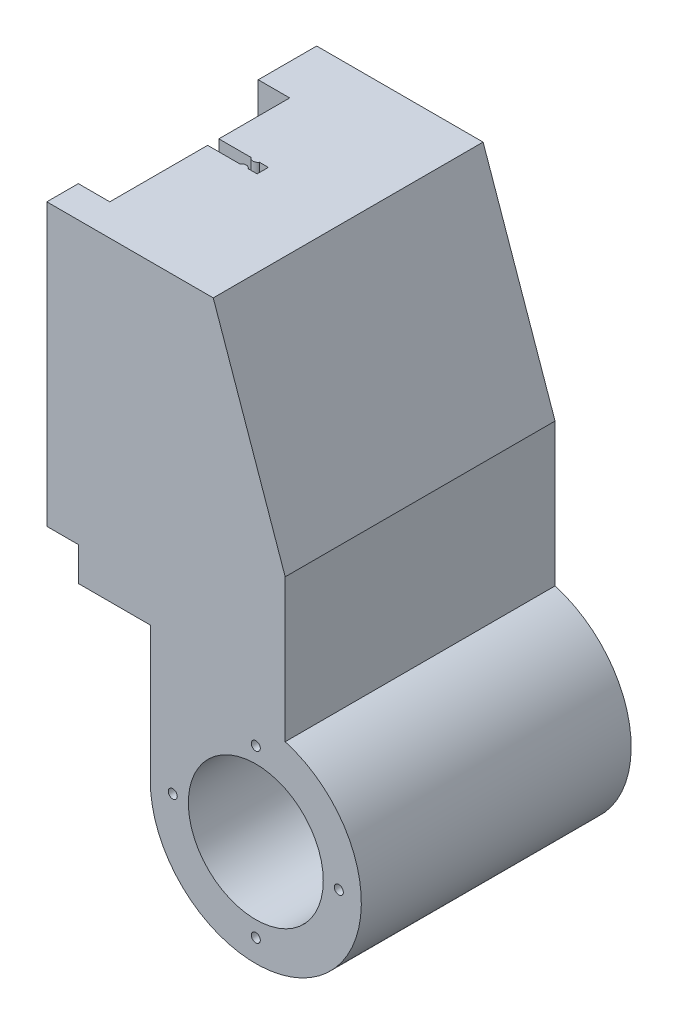
ISO-10303-21;
HEADER;
FILE_DESCRIPTION(('STEP AP214'),'2;1');
FILE_NAME('part.step','',(''),(''),'','','');
FILE_SCHEMA(('AUTOMOTIVE_DESIGN { 1 0 10303 214 1 1 1 1 }'));
ENDSEC;
DATA;
#1=APPLICATION_CONTEXT('core data for automotive mechanical design processes');
#2=APPLICATION_PROTOCOL_DEFINITION('international standard','automotive_design',2000,#1);
#3=PRODUCT_CONTEXT('',#1,'mechanical');
#4=PRODUCT('Part','Part','',(#3));
#5=PRODUCT_RELATED_PRODUCT_CATEGORY('part','',(#4));
#6=PRODUCT_DEFINITION_FORMATION('','',#4);
#7=PRODUCT_DEFINITION_CONTEXT('part definition',#1,'design');
#8=PRODUCT_DEFINITION('design','',#6,#7);
#9=PRODUCT_DEFINITION_SHAPE('','',#8);
#10=(LENGTH_UNIT() NAMED_UNIT(*) SI_UNIT(.MILLI.,.METRE.));
#11=(NAMED_UNIT(*) PLANE_ANGLE_UNIT() SI_UNIT($,.RADIAN.));
#12=(NAMED_UNIT(*) SI_UNIT($,.STERADIAN.) SOLID_ANGLE_UNIT());
#13=UNCERTAINTY_MEASURE_WITH_UNIT(LENGTH_MEASURE(1.E-05),#10,'distance_accuracy_value','');
#14=(GEOMETRIC_REPRESENTATION_CONTEXT(3) GLOBAL_UNCERTAINTY_ASSIGNED_CONTEXT((#13)) GLOBAL_UNIT_ASSIGNED_CONTEXT((#10,
#11,#12)) REPRESENTATION_CONTEXT('',''));
#15=CARTESIAN_POINT('',(0.,0.,0.));
#16=DIRECTION('',(0.,0.,1.));
#17=DIRECTION('',(1.,0.,0.));
#18=AXIS2_PLACEMENT_3D('',#15,#16,#17);
#19=CARTESIAN_POINT('',(-60.8511056883276,0.,0.75546179414232));
#20=DIRECTION('',(1.,0.,0.));
#21=DIRECTION('',(0.,0.,-1.));
#22=AXIS2_PLACEMENT_3D('',#19,#20,#21);
#23=PLANE('',#22);
#24=DIRECTION('',(0.,1.,0.));
#25=VECTOR('',#24,1.);
#26=CARTESIAN_POINT('',(-60.8511056883276,55.0725003083471,53.7554617941423));
#27=LINE('',#26,#25);
#28=CARTESIAN_POINT('',(-60.8511056883276,55.0725003083471,53.7554617941423));
#29=VERTEX_POINT('',#28);
#30=CARTESIAN_POINT('',(-60.8511056883276,117.572500308347,53.7554617941423));
#31=VERTEX_POINT('',#30);
#32=EDGE_CURVE('E300',#29,#31,#27,.T.);
#33=ORIENTED_EDGE('',*,*,#32,.T.);
#34=DIRECTION('',(0.,0.,1.));
#35=VECTOR('',#34,1.);
#36=CARTESIAN_POINT('',(-60.8511056883276,117.572500308347,0.75546179414232));
#37=LINE('',#36,#35);
#38=CARTESIAN_POINT('',(-60.8511056883276,117.572500308347,32.0054617941423));
#39=VERTEX_POINT('',#38);
#40=EDGE_CURVE('E265',#39,#31,#37,.T.);
#41=ORIENTED_EDGE('',*,*,#40,.F.);
#42=DIRECTION('',(0.,1.,0.));
#43=VECTOR('',#42,1.);
#44=CARTESIAN_POINT('',(-60.8511056883276,1.57250030834712,32.0054617941423));
#45=LINE('',#44,#43);
#46=CARTESIAN_POINT('',(-60.8511056883276,47.5725003083471,32.0054617941423));
#47=VERTEX_POINT('',#46);
#48=EDGE_CURVE('E240',#47,#39,#45,.T.);
#49=ORIENTED_EDGE('',*,*,#48,.F.);
#50=DIRECTION('',(0.,0.,-1.));
#51=VECTOR('',#50,1.);
#52=CARTESIAN_POINT('',(-60.8511056883276,47.5725003083471,0.75546179414232));
#53=LINE('',#52,#51);
#54=CARTESIAN_POINT('',(-60.8511056883276,47.5725003083471,60.7554617941423));
#55=VERTEX_POINT('',#54);
#56=EDGE_CURVE('E402',#55,#47,#53,.T.);
#57=ORIENTED_EDGE('',*,*,#56,.F.);
#58=DIRECTION('',(0.,1.,0.));
#59=VECTOR('',#58,1.);
#60=CARTESIAN_POINT('',(-60.8511056883276,16.6168869240189,60.7554617941423));
#61=LINE('',#60,#59);
#62=CARTESIAN_POINT('',(-60.8511056883276,55.0725003083471,60.7554617941423));
#63=VERTEX_POINT('',#62);
#64=EDGE_CURVE('E322',#55,#63,#61,.T.);
#65=ORIENTED_EDGE('',*,*,#64,.T.);
#66=DIRECTION('',(0.,0.,1.));
#67=VECTOR('',#66,1.);
#68=CARTESIAN_POINT('',(-60.8511056883276,55.0725003083471,0.));
#69=LINE('',#68,#67);
#70=EDGE_CURVE('E457',#29,#63,#69,.T.);
#71=ORIENTED_EDGE('',*,*,#70,.F.);
#72=EDGE_LOOP('',(#33,#41,#49,#57,#65,#71));
#73=FACE_BOUND('',#72,.T.);
#74=ADVANCED_FACE('F45',(#73),#23,.F.);
#75=CARTESIAN_POINT('',(0.,0.,60.7554617941423));
#76=DIRECTION('',(0.,0.,1.));
#77=DIRECTION('',(1.,0.,0.));
#78=AXIS2_PLACEMENT_3D('',#75,#76,#77);
#79=PLANE('',#78);
#80=CARTESIAN_POINT('',(-21.3871052024901,17.5725003083471,60.7554617941423));
#81=DIRECTION('',(0.,0.,1.));
#82=DIRECTION('',(1.,0.,0.));
#83=AXIS2_PLACEMENT_3D('',#80,#81,#82);
#84=CIRCLE('',#83,15.);
#85=CARTESIAN_POINT('',(-6.38710520249014,17.5725003083471,60.7554617941423));
#86=VERTEX_POINT('',#85);
#87=EDGE_CURVE('E334',#86,#86,#84,.T.);
#88=ORIENTED_EDGE('',*,*,#87,.F.);
#89=EDGE_LOOP('',(#88));
#90=FACE_BOUND('',#89,.T.);
#91=CARTESIAN_POINT('',(-21.3871052024901,36.0365007941846,60.7554617941423));
#92=DIRECTION('',(0.,0.,1.));
#93=DIRECTION('',(1.,0.,0.));
#94=AXIS2_PLACEMENT_3D('',#91,#92,#93);
#95=CIRCLE('',#94,1.);
#96=CARTESIAN_POINT('',(-20.3871052024901,36.0365007941846,60.7554617941423));
#97=VERTEX_POINT('',#96);
#98=EDGE_CURVE('E342',#97,#97,#95,.T.);
#99=ORIENTED_EDGE('',*,*,#98,.F.);
#100=EDGE_LOOP('',(#99));
#101=FACE_BOUND('',#100,.T.);
#102=CARTESIAN_POINT('',(-2.92310471665268,17.5725003083471,60.7554617941423));
#103=DIRECTION('',(0.,0.,1.));
#104=DIRECTION('',(1.,0.,0.));
#105=AXIS2_PLACEMENT_3D('',#102,#103,#104);
#106=CIRCLE('',#105,1.);
#107=CARTESIAN_POINT('',(-1.92310471665268,17.5725003083471,60.7554617941423));
#108=VERTEX_POINT('',#107);
#109=EDGE_CURVE('E348',#108,#108,#106,.T.);
#110=ORIENTED_EDGE('',*,*,#109,.F.);
#111=EDGE_LOOP('',(#110));
#112=FACE_BOUND('',#111,.T.);
#113=CARTESIAN_POINT('',(-21.3871052024901,-0.891500177490347,60.7554617941423));
#114=DIRECTION('',(0.,0.,1.));
#115=DIRECTION('',(1.,0.,0.));
#116=AXIS2_PLACEMENT_3D('',#113,#114,#115);
#117=CIRCLE('',#116,1.);
#118=CARTESIAN_POINT('',(-20.3871052024901,-0.891500177490347,60.7554617941423));
#119=VERTEX_POINT('',#118);
#120=EDGE_CURVE('E357',#119,#119,#117,.T.);
#121=ORIENTED_EDGE('',*,*,#120,.F.);
#122=EDGE_LOOP('',(#121));
#123=FACE_BOUND('',#122,.T.);
#124=CARTESIAN_POINT('',(-39.8511056883276,17.5725003083471,60.7554617941423));
#125=DIRECTION('',(0.,0.,1.));
#126=DIRECTION('',(1.,0.,0.));
#127=AXIS2_PLACEMENT_3D('',#124,#125,#126);
#128=CIRCLE('',#127,0.999999999999998);
#129=CARTESIAN_POINT('',(-38.8511056883276,17.5725003083471,60.7554617941423));
#130=VERTEX_POINT('',#129);
#131=EDGE_CURVE('E364',#130,#130,#128,.T.);
#132=ORIENTED_EDGE('',*,*,#131,.F.);
#133=EDGE_LOOP('',(#132));
#134=FACE_BOUND('',#133,.T.);
#135=DIRECTION('',(0.,1.,0.));
#136=VECTOR('',#135,1.);
#137=CARTESIAN_POINT('',(-44.8511056883276,1.57250030834712,60.7554617941423));
#138=LINE('',#137,#136);
#139=CARTESIAN_POINT('',(-44.8511056883276,17.5725003083471,60.7554617941423));
#140=VERTEX_POINT('',#139);
#141=CARTESIAN_POINT('',(-44.8511056883276,47.5725003083471,60.7554617941423));
#142=VERTEX_POINT('',#141);
#143=EDGE_CURVE('E406',#140,#142,#138,.T.);
#144=ORIENTED_EDGE('',*,*,#143,.F.);
#145=CARTESIAN_POINT('',(-21.3871052024901,17.5725003083471,60.7554617941423));
#146=DIRECTION('',(0.,0.,1.));
#147=DIRECTION('',(1.,0.,0.));
#148=AXIS2_PLACEMENT_3D('',#145,#146,#147);
#149=CIRCLE('',#148,23.4640004858375);
#150=CARTESIAN_POINT('',(-14.8511056883276,40.1078065887208,60.7554617941423));
#151=VERTEX_POINT('',#150);
#152=EDGE_CURVE('E286',#140,#151,#149,.T.);
#153=ORIENTED_EDGE('',*,*,#152,.T.);
#154=DIRECTION('',(0.,-1.,0.));
#155=VECTOR('',#154,1.);
#156=CARTESIAN_POINT('',(-14.8511056883276,0.,60.7554617941423));
#157=LINE('',#156,#155);
#158=CARTESIAN_POINT('',(-14.8511056883276,71.8582145940614,60.7554617941423));
#159=VERTEX_POINT('',#158);
#160=EDGE_CURVE('E249',#159,#151,#157,.T.);
#161=ORIENTED_EDGE('',*,*,#160,.F.);
#162=DIRECTION('',(0.330350424728106,-0.943858356366018,0.));
#163=VECTOR('',#162,1.);
#164=CARTESIAN_POINT('',(9.17529569674289,3.21135349386001,60.7554617941423));
#165=LINE('',#164,#163);
#166=CARTESIAN_POINT('',(-30.8511056883276,117.572500308347,60.7554617941423));
#167=VERTEX_POINT('',#166);
#168=EDGE_CURVE('E223',#167,#159,#165,.T.);
#169=ORIENTED_EDGE('',*,*,#168,.F.);
#170=DIRECTION('',(1.,0.,0.));
#171=VECTOR('',#170,1.);
#172=CARTESIAN_POINT('',(0.,117.572500308347,60.7554617941423));
#173=LINE('',#172,#171);
#174=CARTESIAN_POINT('',(-67.8511056883276,117.572500308347,60.7554617941423));
#175=VERTEX_POINT('',#174);
#176=EDGE_CURVE('E259',#175,#167,#173,.T.);
#177=ORIENTED_EDGE('',*,*,#176,.F.);
#178=DIRECTION('',(0.,1.,0.));
#179=VECTOR('',#178,1.);
#180=CARTESIAN_POINT('',(-67.8511056883276,55.0725003083471,60.7554617941423));
#181=LINE('',#180,#179);
#182=CARTESIAN_POINT('',(-67.8511056883276,55.0725003083471,60.7554617941423));
#183=VERTEX_POINT('',#182);
#184=EDGE_CURVE('E307',#183,#175,#181,.T.);
#185=ORIENTED_EDGE('',*,*,#184,.F.);
#186=DIRECTION('',(-1.,0.,0.));
#187=VECTOR('',#186,1.);
#188=CARTESIAN_POINT('',(0.,55.0725003083471,60.7554617941423));
#189=LINE('',#188,#187);
#190=EDGE_CURVE('E926',#63,#183,#189,.T.);
#191=ORIENTED_EDGE('',*,*,#190,.F.);
#192=ORIENTED_EDGE('',*,*,#64,.F.);
#193=DIRECTION('',(1.,0.,0.));
#194=VECTOR('',#193,1.);
#195=CARTESIAN_POINT('',(-60.8511056883276,47.5725003083471,60.7554617941423));
#196=LINE('',#195,#194);
#197=EDGE_CURVE('E315',#55,#142,#196,.T.);
#198=ORIENTED_EDGE('',*,*,#197,.T.);
#199=EDGE_LOOP('',(#144,#153,#161,#169,#177,#185,#191,#192,#198));
#200=FACE_BOUND('',#199,.T.);
#201=ADVANCED_FACE('F282',(#90,#101,#112,#123,#134,#200),#79,.T.);
#202=CARTESIAN_POINT('',(0.,0.,0.755461794142321));
#203=DIRECTION('',(0.,0.,1.));
#204=DIRECTION('',(1.,0.,0.));
#205=AXIS2_PLACEMENT_3D('',#202,#203,#204);
#206=PLANE('',#205);
#207=CARTESIAN_POINT('',(-21.3871052024901,17.5725003083471,0.75546179414232));
#208=DIRECTION('',(0.,0.,1.));
#209=DIRECTION('',(1.,0.,0.));
#210=AXIS2_PLACEMENT_3D('',#207,#208,#209);
#211=CIRCLE('',#210,15.);
#212=CARTESIAN_POINT('',(-6.38710520249014,17.5725003083471,0.75546179414232));
#213=VERTEX_POINT('',#212);
#214=EDGE_CURVE('E338',#213,#213,#211,.F.);
#215=ORIENTED_EDGE('',*,*,#214,.F.);
#216=EDGE_LOOP('',(#215));
#217=FACE_BOUND('',#216,.T.);
#218=CARTESIAN_POINT('',(-39.8511056883276,17.5725003083471,0.75546179414232));
#219=DIRECTION('',(0.,0.,1.));
#220=DIRECTION('',(1.,0.,0.));
#221=AXIS2_PLACEMENT_3D('',#218,#219,#220);
#222=CIRCLE('',#221,0.999999999999998);
#223=CARTESIAN_POINT('',(-38.8511056883276,17.5725003083471,0.75546179414232));
#224=VERTEX_POINT('',#223);
#225=EDGE_CURVE('E347',#224,#224,#222,.F.);
#226=ORIENTED_EDGE('',*,*,#225,.F.);
#227=EDGE_LOOP('',(#226));
#228=FACE_BOUND('',#227,.T.);
#229=CARTESIAN_POINT('',(-21.3871052024901,-0.891500177490347,0.75546179414232));
#230=DIRECTION('',(0.,0.,1.));
#231=DIRECTION('',(1.,0.,0.));
#232=AXIS2_PLACEMENT_3D('',#229,#230,#231);
#233=CIRCLE('',#232,1.);
#234=CARTESIAN_POINT('',(-20.3871052024901,-0.891500177490347,0.75546179414232));
#235=VERTEX_POINT('',#234);
#236=EDGE_CURVE('E368',#235,#235,#233,.F.);
#237=ORIENTED_EDGE('',*,*,#236,.F.);
#238=EDGE_LOOP('',(#237));
#239=FACE_BOUND('',#238,.T.);
#240=CARTESIAN_POINT('',(-2.92310471665268,17.5725003083471,0.75546179414232));
#241=DIRECTION('',(0.,0.,1.));
#242=DIRECTION('',(1.,0.,0.));
#243=AXIS2_PLACEMENT_3D('',#240,#241,#242);
#244=CIRCLE('',#243,1.);
#245=CARTESIAN_POINT('',(-1.92310471665268,17.5725003083471,0.75546179414232));
#246=VERTEX_POINT('',#245);
#247=EDGE_CURVE('E352',#246,#246,#244,.F.);
#248=ORIENTED_EDGE('',*,*,#247,.F.);
#249=EDGE_LOOP('',(#248));
#250=FACE_BOUND('',#249,.T.);
#251=CARTESIAN_POINT('',(-21.3871052024901,36.0365007941846,0.75546179414232));
#252=DIRECTION('',(0.,0.,1.));
#253=DIRECTION('',(1.,0.,0.));
#254=AXIS2_PLACEMENT_3D('',#251,#252,#253);
#255=CIRCLE('',#254,1.);
#256=CARTESIAN_POINT('',(-20.3871052024901,36.0365007941846,0.75546179414232));
#257=VERTEX_POINT('',#256);
#258=EDGE_CURVE('E353',#257,#257,#255,.F.);
#259=ORIENTED_EDGE('',*,*,#258,.F.);
#260=EDGE_LOOP('',(#259));
#261=FACE_BOUND('',#260,.T.);
#262=CARTESIAN_POINT('',(-21.3871052024901,17.5725003083471,0.75546179414232));
#263=DIRECTION('',(0.,0.,1.));
#264=DIRECTION('',(1.,0.,0.));
#265=AXIS2_PLACEMENT_3D('',#262,#263,#264);
#266=CIRCLE('',#265,23.4640004858375);
#267=CARTESIAN_POINT('',(-14.8511056883276,40.1078065887208,0.75546179414232));
#268=VERTEX_POINT('',#267);
#269=CARTESIAN_POINT('',(-44.8511056883276,17.5725003083471,0.75546179414232));
#270=VERTEX_POINT('',#269);
#271=EDGE_CURVE('E380',#268,#270,#266,.F.);
#272=ORIENTED_EDGE('',*,*,#271,.T.);
#273=DIRECTION('',(0.,1.,0.));
#274=VECTOR('',#273,1.);
#275=CARTESIAN_POINT('',(-44.8511056883276,1.57250030834712,0.75546179414232));
#276=LINE('',#275,#274);
#277=CARTESIAN_POINT('',(-44.8511056883276,47.5725003083471,0.75546179414232));
#278=VERTEX_POINT('',#277);
#279=EDGE_CURVE('E407',#270,#278,#276,.T.);
#280=ORIENTED_EDGE('',*,*,#279,.T.);
#281=DIRECTION('',(-1.,0.,0.));
#282=VECTOR('',#281,1.);
#283=CARTESIAN_POINT('',(-44.8511056883276,47.5725003083471,0.75546179414232));
#284=LINE('',#283,#282);
#285=CARTESIAN_POINT('',(-60.8511056883276,47.5725003083471,0.75546179414232));
#286=VERTEX_POINT('',#285);
#287=EDGE_CURVE('E71',#278,#286,#284,.T.);
#288=ORIENTED_EDGE('',*,*,#287,.T.);
#289=DIRECTION('',(0.,1.,0.));
#290=VECTOR('',#289,1.);
#291=CARTESIAN_POINT('',(-60.8511056883276,16.6168869240189,0.75546179414232));
#292=LINE('',#291,#290);
#293=CARTESIAN_POINT('',(-60.8511056883276,55.0725003083471,0.75546179414232));
#294=VERTEX_POINT('',#293);
#295=EDGE_CURVE('E330',#286,#294,#292,.T.);
#296=ORIENTED_EDGE('',*,*,#295,.T.);
#297=DIRECTION('',(-1.,0.,0.));
#298=VECTOR('',#297,1.);
#299=CARTESIAN_POINT('',(0.,55.0725003083471,0.755461794142313));
#300=LINE('',#299,#298);
#301=CARTESIAN_POINT('',(-67.8511056883276,55.0725003083471,0.755461794142321));
#302=VERTEX_POINT('',#301);
#303=EDGE_CURVE('E310',#294,#302,#300,.T.);
#304=ORIENTED_EDGE('',*,*,#303,.T.);
#305=DIRECTION('',(0.,1.,0.));
#306=VECTOR('',#305,1.);
#307=CARTESIAN_POINT('',(-67.8511056883276,55.0725003083471,0.755461794142321));
#308=LINE('',#307,#306);
#309=CARTESIAN_POINT('',(-67.8511056883276,117.572500308347,0.755461794142321));
#310=VERTEX_POINT('',#309);
#311=EDGE_CURVE('E294',#302,#310,#308,.T.);
#312=ORIENTED_EDGE('',*,*,#311,.T.);
#313=DIRECTION('',(1.,0.,0.));
#314=VECTOR('',#313,1.);
#315=CARTESIAN_POINT('',(0.,117.572500308347,0.75546179414232));
#316=LINE('',#315,#314);
#317=CARTESIAN_POINT('',(-30.8511056883276,117.572500308347,0.75546179414232));
#318=VERTEX_POINT('',#317);
#319=EDGE_CURVE('E248',#310,#318,#316,.T.);
#320=ORIENTED_EDGE('',*,*,#319,.T.);
#321=DIRECTION('',(0.330350424728106,-0.943858356366018,0.));
#322=VECTOR('',#321,1.);
#323=CARTESIAN_POINT('',(9.17529569674289,3.21135349386001,0.75546179414232));
#324=LINE('',#323,#322);
#325=CARTESIAN_POINT('',(-14.8511056883276,71.8582145940614,0.75546179414232));
#326=VERTEX_POINT('',#325);
#327=EDGE_CURVE('E244',#318,#326,#324,.T.);
#328=ORIENTED_EDGE('',*,*,#327,.T.);
#329=DIRECTION('',(0.,-1.,0.));
#330=VECTOR('',#329,1.);
#331=CARTESIAN_POINT('',(-14.8511056883276,0.,0.75546179414232));
#332=LINE('',#331,#330);
#333=EDGE_CURVE('E252',#326,#268,#332,.T.);
#334=ORIENTED_EDGE('',*,*,#333,.T.);
#335=EDGE_LOOP('',(#272,#280,#288,#296,#304,#312,#320,#328,#334));
#336=FACE_BOUND('',#335,.T.);
#337=ADVANCED_FACE('F47',(#217,#228,#239,#250,#261,#336),#206,.F.);
#338=CARTESIAN_POINT('',(-44.8511056883276,0.,60.7554617941423));
#339=DIRECTION('',(-1.,0.,0.));
#340=DIRECTION('',(0.,0.,1.));
#341=AXIS2_PLACEMENT_3D('',#338,#339,#340);
#342=PLANE('',#341);
#343=ORIENTED_EDGE('',*,*,#279,.F.);
#344=DIRECTION('',(0.,0.,1.));
#345=VECTOR('',#344,1.);
#346=CARTESIAN_POINT('',(-44.8511056883276,17.5725003083471,-11.4411521578247));
#347=LINE('',#346,#345);
#348=EDGE_CURVE('E343',#270,#140,#347,.T.);
#349=ORIENTED_EDGE('',*,*,#348,.T.);
#350=ORIENTED_EDGE('',*,*,#143,.T.);
#351=DIRECTION('',(0.,0.,-1.));
#352=VECTOR('',#351,1.);
#353=CARTESIAN_POINT('',(-44.8511056883276,47.5725003083471,60.7554617941423));
#354=LINE('',#353,#352);
#355=EDGE_CURVE('E385',#142,#278,#354,.T.);
#356=ORIENTED_EDGE('',*,*,#355,.T.);
#357=EDGE_LOOP('',(#343,#349,#350,#356));
#358=FACE_BOUND('',#357,.T.);
#359=ADVANCED_FACE('F522',(#358),#342,.T.);
#360=CARTESIAN_POINT('',(-60.8511056883276,117.572500308347,13.7554617941423));
#361=VERTEX_POINT('',#360);
#362=CARTESIAN_POINT('',(-60.8511056883276,117.572500308347,29.5054617941423));
#363=VERTEX_POINT('',#362);
#364=EDGE_CURVE('E55',#361,#363,#37,.T.);
#365=ORIENTED_EDGE('',*,*,#364,.F.);
#366=DIRECTION('',(0.,1.,0.));
#367=VECTOR('',#366,1.);
#368=CARTESIAN_POINT('',(-60.8511056883276,55.0725003083471,13.7554617941423));
#369=LINE('',#368,#367);
#370=CARTESIAN_POINT('',(-60.8511056883276,55.0725003083471,13.7554617941423));
#371=VERTEX_POINT('',#370);
#372=EDGE_CURVE('E316',#371,#361,#369,.T.);
#373=ORIENTED_EDGE('',*,*,#372,.F.);
#374=DIRECTION('',(0.,0.,1.));
#375=VECTOR('',#374,1.);
#376=CARTESIAN_POINT('',(-60.8511056883276,55.0725003083471,0.));
#377=LINE('',#376,#375);
#378=EDGE_CURVE('E484',#294,#371,#377,.T.);
#379=ORIENTED_EDGE('',*,*,#378,.F.);
#380=ORIENTED_EDGE('',*,*,#295,.F.);
#381=DIRECTION('',(0.,0.,-1.));
#382=VECTOR('',#381,1.);
#383=CARTESIAN_POINT('',(-60.8511056883276,47.5725003083471,0.75546179414232));
#384=LINE('',#383,#382);
#385=CARTESIAN_POINT('',(-60.8511056883276,47.5725003083471,29.5054617941423));
#386=VERTEX_POINT('',#385);
#387=EDGE_CURVE('E389',#386,#286,#384,.T.);
#388=ORIENTED_EDGE('',*,*,#387,.F.);
#389=DIRECTION('',(0.,1.,0.));
#390=VECTOR('',#389,1.);
#391=CARTESIAN_POINT('',(-60.8511056883276,1.57250030834712,29.5054617941423));
#392=LINE('',#391,#390);
#393=EDGE_CURVE('E219',#386,#363,#392,.T.);
#394=ORIENTED_EDGE('',*,*,#393,.T.);
#395=EDGE_LOOP('',(#365,#373,#379,#380,#388,#394));
#396=FACE_BOUND('',#395,.T.);
#397=ADVANCED_FACE('F495',(#396),#23,.F.);
#398=CARTESIAN_POINT('',(-52.7588599983276,1.57250030834712,28.9161760798566));
#399=DIRECTION('',(0.,1.,0.));
#400=DIRECTION('',(0.,0.,1.));
#401=AXIS2_PLACEMENT_3D('',#398,#399,#400);
#402=CYLINDRICAL_SURFACE('',#401,1.09224569);
#403=CARTESIAN_POINT('',(-52.7588599983276,87.5725003083471,28.9161760798566));
#404=DIRECTION('',(0.,1.,0.));
#405=DIRECTION('',(0.,0.,1.));
#406=AXIS2_PLACEMENT_3D('',#403,#404,#405);
#407=CIRCLE('',#406,1.09224569);
#408=CARTESIAN_POINT('',(-51.8392171359825,87.5725003083471,29.5054617941423));
#409=VERTEX_POINT('',#408);
#410=CARTESIAN_POINT('',(-53.6785028606727,87.5725003083471,29.5054617941423));
#411=VERTEX_POINT('',#410);
#412=EDGE_CURVE('E193',#409,#411,#407,.F.);
#413=ORIENTED_EDGE('',*,*,#412,.F.);
#414=DIRECTION('',(0.,1.,0.));
#415=VECTOR('',#414,1.);
#416=CARTESIAN_POINT('',(-51.8392171359825,1.57250030834712,29.5054617941423));
#417=LINE('',#416,#415);
#418=CARTESIAN_POINT('',(-51.8392171359825,117.572500308347,29.5054617941423));
#419=VERTEX_POINT('',#418);
#420=EDGE_CURVE('E210',#409,#419,#417,.T.);
#421=ORIENTED_EDGE('',*,*,#420,.T.);
#422=CARTESIAN_POINT('',(-52.7588599983276,117.572500308347,28.9161760798566));
#423=DIRECTION('',(0.,1.,0.));
#424=DIRECTION('',(0.,0.,1.));
#425=AXIS2_PLACEMENT_3D('',#422,#423,#424);
#426=CIRCLE('',#425,1.09224569);
#427=CARTESIAN_POINT('',(-53.6785028606727,117.572500308347,29.5054617941423));
#428=VERTEX_POINT('',#427);
#429=EDGE_CURVE('E216',#428,#419,#426,.T.);
#430=ORIENTED_EDGE('',*,*,#429,.F.);
#431=DIRECTION('',(0.,1.,0.));
#432=VECTOR('',#431,1.);
#433=CARTESIAN_POINT('',(-53.6785028606727,1.57250030834712,29.5054617941423));
#434=LINE('',#433,#432);
#435=EDGE_CURVE('E207',#411,#428,#434,.T.);
#436=ORIENTED_EDGE('',*,*,#435,.F.);
#437=EDGE_LOOP('',(#413,#421,#430,#436));
#438=FACE_BOUND('',#437,.T.);
#439=ADVANCED_FACE('F214',(#438),#402,.T.);
#440=CARTESIAN_POINT('',(0.,1.57250030834712,29.5054617941423));
#441=DIRECTION('',(0.,0.,-1.));
#442=DIRECTION('',(-1.,0.,0.));
#443=AXIS2_PLACEMENT_3D('',#440,#441,#442);
#444=PLANE('',#443);
#445=ORIENTED_EDGE('',*,*,#420,.F.);
#446=DIRECTION('',(1.,0.,0.));
#447=VECTOR('',#446,1.);
#448=CARTESIAN_POINT('',(-49.8511056883276,87.5725003083471,29.5054617941423));
#449=LINE('',#448,#447);
#450=EDGE_CURVE('E196',#411,#409,#449,.T.);
#451=ORIENTED_EDGE('',*,*,#450,.F.);
#452=ORIENTED_EDGE('',*,*,#435,.T.);
#453=DIRECTION('',(-1.,0.,0.));
#454=VECTOR('',#453,1.);
#455=CARTESIAN_POINT('',(0.,117.572500308347,29.5054617941423));
#456=LINE('',#455,#454);
#457=EDGE_CURVE('E243',#428,#363,#456,.T.);
#458=ORIENTED_EDGE('',*,*,#457,.T.);
#459=ORIENTED_EDGE('',*,*,#393,.F.);
#460=DIRECTION('',(-1.,0.,0.));
#461=VECTOR('',#460,1.);
#462=CARTESIAN_POINT('',(0.,47.5725003083471,29.5054617941423));
#463=LINE('',#462,#461);
#464=CARTESIAN_POINT('',(-49.8511056883276,47.5725003083471,29.5054617941423));
#465=VERTEX_POINT('',#464);
#466=EDGE_CURVE('E392',#465,#386,#463,.T.);
#467=ORIENTED_EDGE('',*,*,#466,.F.);
#468=DIRECTION('',(0.,1.,0.));
#469=VECTOR('',#468,1.);
#470=CARTESIAN_POINT('',(-49.8511056883276,1.57250030834712,29.5054617941423));
#471=LINE('',#470,#469);
#472=CARTESIAN_POINT('',(-49.8511056883276,117.572500308347,29.5054617941423));
#473=VERTEX_POINT('',#472);
#474=EDGE_CURVE('E225',#465,#473,#471,.T.);
#475=ORIENTED_EDGE('',*,*,#474,.T.);
#476=DIRECTION('',(-1.,0.,0.));
#477=VECTOR('',#476,1.);
#478=CARTESIAN_POINT('',(0.,117.572500308347,29.5054617941423));
#479=LINE('',#478,#477);
#480=EDGE_CURVE('E428',#473,#419,#479,.T.);
#481=ORIENTED_EDGE('',*,*,#480,.T.);
#482=EDGE_LOOP('',(#445,#451,#452,#458,#459,#467,#475,#481));
#483=FACE_BOUND('',#482,.T.);
#484=ADVANCED_FACE('F205',(#483),#444,.F.);
#485=CARTESIAN_POINT('',(-49.8511056883276,1.57250030834712,0.));
#486=DIRECTION('',(-1.,0.,0.));
#487=DIRECTION('',(0.,0.,1.));
#488=AXIS2_PLACEMENT_3D('',#485,#486,#487);
#489=PLANE('',#488);
#490=DIRECTION('',(0.,0.,1.));
#491=VECTOR('',#490,1.);
#492=CARTESIAN_POINT('',(-49.8511056883276,117.572500308347,0.));
#493=LINE('',#492,#491);
#494=CARTESIAN_POINT('',(-49.8511056883276,117.572500308347,32.0054617941423));
#495=VERTEX_POINT('',#494);
#496=EDGE_CURVE('E424',#473,#495,#493,.T.);
#497=ORIENTED_EDGE('',*,*,#496,.F.);
#498=ORIENTED_EDGE('',*,*,#474,.F.);
#499=DIRECTION('',(0.,0.,1.));
#500=VECTOR('',#499,1.);
#501=CARTESIAN_POINT('',(-49.8511056883276,47.5725003083471,0.));
#502=LINE('',#501,#500);
#503=CARTESIAN_POINT('',(-49.8511056883276,47.5725003083471,32.0054617941423));
#504=VERTEX_POINT('',#503);
#505=EDGE_CURVE('E395',#465,#504,#502,.T.);
#506=ORIENTED_EDGE('',*,*,#505,.T.);
#507=DIRECTION('',(0.,1.,0.));
#508=VECTOR('',#507,1.);
#509=CARTESIAN_POINT('',(-49.8511056883276,1.57250030834712,32.0054617941423));
#510=LINE('',#509,#508);
#511=EDGE_CURVE('E231',#504,#495,#510,.T.);
#512=ORIENTED_EDGE('',*,*,#511,.T.);
#513=EDGE_LOOP('',(#497,#498,#506,#512));
#514=FACE_BOUND('',#513,.T.);
#515=ADVANCED_FACE('F439',(#514),#489,.T.);
#516=CARTESIAN_POINT('',(-52.7588599983276,1.57250030834712,32.594747508428));
#517=DIRECTION('',(0.,1.,0.));
#518=DIRECTION('',(0.,0.,1.));
#519=AXIS2_PLACEMENT_3D('',#516,#517,#518);
#520=CYLINDRICAL_SURFACE('',#519,1.09224569);
#521=CARTESIAN_POINT('',(-52.7588599983276,87.5725003083471,32.594747508428));
#522=DIRECTION('',(0.,1.,0.));
#523=DIRECTION('',(0.,0.,1.));
#524=AXIS2_PLACEMENT_3D('',#521,#522,#523);
#525=CIRCLE('',#524,1.09224569);
#526=CARTESIAN_POINT('',(-53.6785028606727,87.5725003083471,32.0054617941423));
#527=VERTEX_POINT('',#526);
#528=CARTESIAN_POINT('',(-51.8392171359825,87.5725003083471,32.0054617941423));
#529=VERTEX_POINT('',#528);
#530=EDGE_CURVE('E202',#527,#529,#525,.F.);
#531=ORIENTED_EDGE('',*,*,#530,.F.);
#532=DIRECTION('',(0.,1.,0.));
#533=VECTOR('',#532,1.);
#534=CARTESIAN_POINT('',(-53.6785028606727,1.57250030834712,32.0054617941423));
#535=LINE('',#534,#533);
#536=CARTESIAN_POINT('',(-53.6785028606727,117.572500308347,32.0054617941423));
#537=VERTEX_POINT('',#536);
#538=EDGE_CURVE('E237',#527,#537,#535,.T.);
#539=ORIENTED_EDGE('',*,*,#538,.T.);
#540=CARTESIAN_POINT('',(-52.7588599983276,117.572500308347,32.594747508428));
#541=DIRECTION('',(0.,1.,0.));
#542=DIRECTION('',(0.,0.,1.));
#543=AXIS2_PLACEMENT_3D('',#540,#541,#542);
#544=CIRCLE('',#543,1.09224569);
#545=CARTESIAN_POINT('',(-51.8392171359825,117.572500308347,32.0054617941423));
#546=VERTEX_POINT('',#545);
#547=EDGE_CURVE('E416',#546,#537,#544,.T.);
#548=ORIENTED_EDGE('',*,*,#547,.F.);
#549=DIRECTION('',(0.,1.,0.));
#550=VECTOR('',#549,1.);
#551=CARTESIAN_POINT('',(-51.8392171359825,1.57250030834712,32.0054617941423));
#552=LINE('',#551,#550);
#553=EDGE_CURVE('E234',#529,#546,#552,.T.);
#554=ORIENTED_EDGE('',*,*,#553,.F.);
#555=EDGE_LOOP('',(#531,#539,#548,#554));
#556=FACE_BOUND('',#555,.T.);
#557=ADVANCED_FACE('F451',(#556),#520,.T.);
#558=CARTESIAN_POINT('',(0.,1.57250030834712,32.0054617941423));
#559=DIRECTION('',(0.,0.,-1.));
#560=DIRECTION('',(-1.,0.,0.));
#561=AXIS2_PLACEMENT_3D('',#558,#559,#560);
#562=PLANE('',#561);
#563=ORIENTED_EDGE('',*,*,#538,.F.);
#564=DIRECTION('',(-1.,0.,0.));
#565=VECTOR('',#564,1.);
#566=CARTESIAN_POINT('',(-60.8511056883276,87.5725003083471,32.0054617941423));
#567=LINE('',#566,#565);
#568=EDGE_CURVE('E212',#529,#527,#567,.T.);
#569=ORIENTED_EDGE('',*,*,#568,.F.);
#570=ORIENTED_EDGE('',*,*,#553,.T.);
#571=DIRECTION('',(-1.,0.,0.));
#572=VECTOR('',#571,1.);
#573=CARTESIAN_POINT('',(0.,117.572500308347,32.0054617941423));
#574=LINE('',#573,#572);
#575=EDGE_CURVE('E420',#495,#546,#574,.T.);
#576=ORIENTED_EDGE('',*,*,#575,.F.);
#577=ORIENTED_EDGE('',*,*,#511,.F.);
#578=DIRECTION('',(-1.,0.,0.));
#579=VECTOR('',#578,1.);
#580=CARTESIAN_POINT('',(0.,47.5725003083471,32.0054617941423));
#581=LINE('',#580,#579);
#582=EDGE_CURVE('E399',#504,#47,#581,.T.);
#583=ORIENTED_EDGE('',*,*,#582,.T.);
#584=ORIENTED_EDGE('',*,*,#48,.T.);
#585=DIRECTION('',(-1.,0.,0.));
#586=VECTOR('',#585,1.);
#587=CARTESIAN_POINT('',(0.,117.572500308347,32.0054617941423));
#588=LINE('',#587,#586);
#589=EDGE_CURVE('E410',#537,#39,#588,.T.);
#590=ORIENTED_EDGE('',*,*,#589,.F.);
#591=EDGE_LOOP('',(#563,#569,#570,#576,#577,#583,#584,#590));
#592=FACE_BOUND('',#591,.T.);
#593=ADVANCED_FACE('F444',(#592),#562,.T.);
#594=CARTESIAN_POINT('',(9.17529569674289,3.21135349386001,0.75546179414232));
#595=DIRECTION('',(-0.943858356366017,-0.330350424728106,0.));
#596=DIRECTION('',(0.330350424728106,-0.943858356366017,0.));
#597=AXIS2_PLACEMENT_3D('',#594,#595,#596);
#598=PLANE('',#597);
#599=ORIENTED_EDGE('',*,*,#168,.T.);
#600=DIRECTION('',(0.,0.,1.));
#601=VECTOR('',#600,1.);
#602=CARTESIAN_POINT('',(-14.8511056883276,71.8582145940614,0.75546179414232));
#603=LINE('',#602,#601);
#604=EDGE_CURVE('E11',#326,#159,#603,.T.);
#605=ORIENTED_EDGE('',*,*,#604,.F.);
#606=ORIENTED_EDGE('',*,*,#327,.F.);
#607=DIRECTION('',(0.,0.,1.));
#608=VECTOR('',#607,1.);
#609=CARTESIAN_POINT('',(-30.8511056883276,117.572500308347,0.75546179414232));
#610=LINE('',#609,#608);
#611=EDGE_CURVE('E49',#318,#167,#610,.T.);
#612=ORIENTED_EDGE('',*,*,#611,.T.);
#613=EDGE_LOOP('',(#599,#605,#606,#612));
#614=FACE_BOUND('',#613,.T.);
#615=ADVANCED_FACE('F278',(#614),#598,.F.);
#616=CARTESIAN_POINT('',(-14.8511056883276,0.,0.75546179414232));
#617=DIRECTION('',(-1.,0.,0.));
#618=DIRECTION('',(0.,-1.,0.));
#619=AXIS2_PLACEMENT_3D('',#616,#617,#618);
#620=PLANE('',#619);
#621=ORIENTED_EDGE('',*,*,#160,.T.);
#622=DIRECTION('',(0.,0.,1.));
#623=VECTOR('',#622,1.);
#624=CARTESIAN_POINT('',(-14.8511056883276,40.1078065887208,-65.6107536350581));
#625=LINE('',#624,#623);
#626=EDGE_CURVE('E290',#151,#268,#625,.F.);
#627=ORIENTED_EDGE('',*,*,#626,.T.);
#628=ORIENTED_EDGE('',*,*,#333,.F.);
#629=ORIENTED_EDGE('',*,*,#604,.T.);
#630=EDGE_LOOP('',(#621,#627,#628,#629));
#631=FACE_BOUND('',#630,.T.);
#632=ADVANCED_FACE('F289',(#631),#620,.F.);
#633=CARTESIAN_POINT('',(0.,117.572500308347,0.75546179414232));
#634=DIRECTION('',(0.,-1.,0.));
#635=DIRECTION('',(0.,0.,-1.));
#636=AXIS2_PLACEMENT_3D('',#633,#634,#635);
#637=PLANE('',#636);
#638=ORIENTED_EDGE('',*,*,#319,.F.);
#639=DIRECTION('',(0.,0.,1.));
#640=VECTOR('',#639,1.);
#641=CARTESIAN_POINT('',(-67.8511056883276,117.572500308347,0.));
#642=LINE('',#641,#640);
#643=CARTESIAN_POINT('',(-67.8511056883276,117.572500308347,13.7554617941423));
#644=VERTEX_POINT('',#643);
#645=EDGE_CURVE('E297',#310,#644,#642,.T.);
#646=ORIENTED_EDGE('',*,*,#645,.T.);
#647=DIRECTION('',(1.,0.,0.));
#648=VECTOR('',#647,1.);
#649=CARTESIAN_POINT('',(0.,117.572500308347,13.7554617941423));
#650=LINE('',#649,#648);
#651=EDGE_CURVE('E63',#644,#361,#650,.T.);
#652=ORIENTED_EDGE('',*,*,#651,.T.);
#653=ORIENTED_EDGE('',*,*,#364,.T.);
#654=ORIENTED_EDGE('',*,*,#457,.F.);
#655=ORIENTED_EDGE('',*,*,#429,.T.);
#656=ORIENTED_EDGE('',*,*,#480,.F.);
#657=ORIENTED_EDGE('',*,*,#496,.T.);
#658=ORIENTED_EDGE('',*,*,#575,.T.);
#659=ORIENTED_EDGE('',*,*,#547,.T.);
#660=ORIENTED_EDGE('',*,*,#589,.T.);
#661=ORIENTED_EDGE('',*,*,#40,.T.);
#662=DIRECTION('',(1.,0.,0.));
#663=VECTOR('',#662,1.);
#664=CARTESIAN_POINT('',(0.,117.572500308347,53.7554617941423));
#665=LINE('',#664,#663);
#666=CARTESIAN_POINT('',(-67.8511056883276,117.572500308347,53.7554617941423));
#667=VERTEX_POINT('',#666);
#668=EDGE_CURVE('E201',#667,#31,#665,.T.);
#669=ORIENTED_EDGE('',*,*,#668,.F.);
#670=DIRECTION('',(0.,0.,-1.));
#671=VECTOR('',#670,1.);
#672=CARTESIAN_POINT('',(-67.8511056883276,117.572500308347,0.));
#673=LINE('',#672,#671);
#674=EDGE_CURVE('E467',#175,#667,#673,.T.);
#675=ORIENTED_EDGE('',*,*,#674,.F.);
#676=ORIENTED_EDGE('',*,*,#176,.T.);
#677=ORIENTED_EDGE('',*,*,#611,.F.);
#678=EDGE_LOOP('',(#638,#646,#652,#653,#654,#655,#656,#657,#658,#659,#660,#661,#669,#675,#676,#677));
#679=FACE_BOUND('',#678,.T.);
#680=ADVANCED_FACE('F296',(#679),#637,.F.);
#681=CARTESIAN_POINT('',(0.,47.5725003083471,60.7554617941423));
#682=DIRECTION('',(0.,-1.,0.));
#683=DIRECTION('',(0.,0.,-1.));
#684=AXIS2_PLACEMENT_3D('',#681,#682,#683);
#685=PLANE('',#684);
#686=ORIENTED_EDGE('',*,*,#56,.T.);
#687=ORIENTED_EDGE('',*,*,#582,.F.);
#688=ORIENTED_EDGE('',*,*,#505,.F.);
#689=ORIENTED_EDGE('',*,*,#466,.T.);
#690=ORIENTED_EDGE('',*,*,#387,.T.);
#691=ORIENTED_EDGE('',*,*,#287,.F.);
#692=ORIENTED_EDGE('',*,*,#355,.F.);
#693=ORIENTED_EDGE('',*,*,#197,.F.);
#694=EDGE_LOOP('',(#686,#687,#688,#689,#690,#691,#692,#693));
#695=FACE_BOUND('',#694,.T.);
#696=ADVANCED_FACE('F539',(#695),#685,.T.);
#697=CARTESIAN_POINT('',(-21.3871052024901,17.5725003083471,-65.6107536350581));
#698=DIRECTION('',(0.,0.,1.));
#699=DIRECTION('',(1.,0.,0.));
#700=AXIS2_PLACEMENT_3D('',#697,#698,#699);
#701=CYLINDRICAL_SURFACE('',#700,23.4640004858375);
#702=ORIENTED_EDGE('',*,*,#152,.F.);
#703=ORIENTED_EDGE('',*,*,#348,.F.);
#704=ORIENTED_EDGE('',*,*,#271,.F.);
#705=ORIENTED_EDGE('',*,*,#626,.F.);
#706=EDGE_LOOP('',(#702,#703,#704,#705));
#707=FACE_BOUND('',#706,.T.);
#708=ADVANCED_FACE('F537',(#707),#701,.T.);
#709=CARTESIAN_POINT('',(-39.8511056883276,17.5725003083471,-11.4411521578247));
#710=DIRECTION('',(0.,0.,1.));
#711=DIRECTION('',(1.,0.,0.));
#712=AXIS2_PLACEMENT_3D('',#709,#710,#711);
#713=CYLINDRICAL_SURFACE('',#712,0.999999999999998);
#714=ORIENTED_EDGE('',*,*,#225,.T.);
#715=EDGE_LOOP('',(#714));
#716=FACE_BOUND('',#715,.T.);
#717=ORIENTED_EDGE('',*,*,#131,.T.);
#718=EDGE_LOOP('',(#717));
#719=FACE_BOUND('',#718,.T.);
#720=ADVANCED_FACE('F784',(#716,#719),#713,.F.);
#721=CARTESIAN_POINT('',(-21.3871052024901,-0.891500177490347,-11.4411521578247));
#722=DIRECTION('',(0.,0.,1.));
#723=DIRECTION('',(1.,0.,0.));
#724=AXIS2_PLACEMENT_3D('',#721,#722,#723);
#725=CYLINDRICAL_SURFACE('',#724,1.);
#726=ORIENTED_EDGE('',*,*,#236,.T.);
#727=EDGE_LOOP('',(#726));
#728=FACE_BOUND('',#727,.T.);
#729=ORIENTED_EDGE('',*,*,#120,.T.);
#730=EDGE_LOOP('',(#729));
#731=FACE_BOUND('',#730,.T.);
#732=ADVANCED_FACE('F794',(#728,#731),#725,.F.);
#733=CARTESIAN_POINT('',(-2.92310471665268,17.5725003083471,-11.4411521578247));
#734=DIRECTION('',(0.,0.,1.));
#735=DIRECTION('',(1.,0.,0.));
#736=AXIS2_PLACEMENT_3D('',#733,#734,#735);
#737=CYLINDRICAL_SURFACE('',#736,1.);
#738=ORIENTED_EDGE('',*,*,#247,.T.);
#739=EDGE_LOOP('',(#738));
#740=FACE_BOUND('',#739,.T.);
#741=ORIENTED_EDGE('',*,*,#109,.T.);
#742=EDGE_LOOP('',(#741));
#743=FACE_BOUND('',#742,.T.);
#744=ADVANCED_FACE('F805',(#740,#743),#737,.F.);
#745=CARTESIAN_POINT('',(-21.3871052024901,36.0365007941846,-11.4411521578247));
#746=DIRECTION('',(0.,0.,1.));
#747=DIRECTION('',(1.,0.,0.));
#748=AXIS2_PLACEMENT_3D('',#745,#746,#747);
#749=CYLINDRICAL_SURFACE('',#748,1.);
#750=ORIENTED_EDGE('',*,*,#258,.T.);
#751=EDGE_LOOP('',(#750));
#752=FACE_BOUND('',#751,.T.);
#753=ORIENTED_EDGE('',*,*,#98,.T.);
#754=EDGE_LOOP('',(#753));
#755=FACE_BOUND('',#754,.T.);
#756=ADVANCED_FACE('F509',(#752,#755),#749,.F.);
#757=CARTESIAN_POINT('',(-21.3871052024901,17.5725003083471,-41.6709450770505));
#758=DIRECTION('',(0.,0.,1.));
#759=DIRECTION('',(1.,0.,0.));
#760=AXIS2_PLACEMENT_3D('',#757,#758,#759);
#761=CYLINDRICAL_SURFACE('',#760,15.);
#762=ORIENTED_EDGE('',*,*,#214,.T.);
#763=EDGE_LOOP('',(#762));
#764=FACE_BOUND('',#763,.T.);
#765=ORIENTED_EDGE('',*,*,#87,.T.);
#766=EDGE_LOOP('',(#765));
#767=FACE_BOUND('',#766,.T.);
#768=ADVANCED_FACE('F501',(#764,#767),#761,.F.);
#769=CARTESIAN_POINT('',(-67.8511056883276,55.0725003083471,0.));
#770=DIRECTION('',(-1.,0.,0.));
#771=DIRECTION('',(0.,0.,1.));
#772=AXIS2_PLACEMENT_3D('',#769,#770,#771);
#773=PLANE('',#772);
#774=ORIENTED_EDGE('',*,*,#645,.F.);
#775=ORIENTED_EDGE('',*,*,#311,.F.);
#776=DIRECTION('',(0.,0.,1.));
#777=VECTOR('',#776,1.);
#778=CARTESIAN_POINT('',(-67.8511056883276,55.0725003083471,0.));
#779=LINE('',#778,#777);
#780=CARTESIAN_POINT('',(-67.8511056883276,55.0725003083471,13.7554617941423));
#781=VERTEX_POINT('',#780);
#782=EDGE_CURVE('E304',#302,#781,#779,.T.);
#783=ORIENTED_EDGE('',*,*,#782,.T.);
#784=DIRECTION('',(0.,1.,0.));
#785=VECTOR('',#784,1.);
#786=CARTESIAN_POINT('',(-67.8511056883276,55.0725003083471,13.7554617941423));
#787=LINE('',#786,#785);
#788=EDGE_CURVE('E319',#781,#644,#787,.T.);
#789=ORIENTED_EDGE('',*,*,#788,.T.);
#790=EDGE_LOOP('',(#774,#775,#783,#789));
#791=FACE_BOUND('',#790,.T.);
#792=ADVANCED_FACE('F499',(#791),#773,.T.);
#793=CARTESIAN_POINT('',(0.,55.0725003083471,13.7554617941423));
#794=DIRECTION('',(0.,0.,1.));
#795=DIRECTION('',(1.,0.,0.));
#796=AXIS2_PLACEMENT_3D('',#793,#794,#795);
#797=PLANE('',#796);
#798=ORIENTED_EDGE('',*,*,#651,.F.);
#799=ORIENTED_EDGE('',*,*,#788,.F.);
#800=DIRECTION('',(1.,0.,0.));
#801=VECTOR('',#800,1.);
#802=CARTESIAN_POINT('',(0.,55.0725003083471,13.7554617941423));
#803=LINE('',#802,#801);
#804=EDGE_CURVE('E481',#781,#371,#803,.T.);
#805=ORIENTED_EDGE('',*,*,#804,.T.);
#806=ORIENTED_EDGE('',*,*,#372,.T.);
#807=EDGE_LOOP('',(#798,#799,#805,#806));
#808=FACE_BOUND('',#807,.T.);
#809=ADVANCED_FACE('F498',(#808),#797,.T.);
#810=CARTESIAN_POINT('',(0.,55.0725003083471,0.));
#811=DIRECTION('',(0.,1.,0.));
#812=DIRECTION('',(0.,0.,1.));
#813=AXIS2_PLACEMENT_3D('',#810,#811,#812);
#814=PLANE('',#813);
#815=ORIENTED_EDGE('',*,*,#782,.F.);
#816=ORIENTED_EDGE('',*,*,#303,.F.);
#817=ORIENTED_EDGE('',*,*,#378,.T.);
#818=ORIENTED_EDGE('',*,*,#804,.F.);
#819=EDGE_LOOP('',(#815,#816,#817,#818));
#820=FACE_BOUND('',#819,.T.);
#821=ADVANCED_FACE('F492',(#820),#814,.F.);
#822=CARTESIAN_POINT('',(0.,55.0725003083471,53.7554617941423));
#823=DIRECTION('',(0.,0.,1.));
#824=DIRECTION('',(1.,0.,0.));
#825=AXIS2_PLACEMENT_3D('',#822,#823,#824);
#826=PLANE('',#825);
#827=ORIENTED_EDGE('',*,*,#668,.T.);
#828=ORIENTED_EDGE('',*,*,#32,.F.);
#829=DIRECTION('',(1.,0.,0.));
#830=VECTOR('',#829,1.);
#831=CARTESIAN_POINT('',(0.,55.0725003083471,53.7554617941423));
#832=LINE('',#831,#830);
#833=CARTESIAN_POINT('',(-67.8511056883276,55.0725003083471,53.7554617941423));
#834=VERTEX_POINT('',#833);
#835=EDGE_CURVE('E462',#834,#29,#832,.T.);
#836=ORIENTED_EDGE('',*,*,#835,.F.);
#837=DIRECTION('',(0.,1.,0.));
#838=VECTOR('',#837,1.);
#839=CARTESIAN_POINT('',(-67.8511056883276,55.0725003083471,53.7554617941423));
#840=LINE('',#839,#838);
#841=EDGE_CURVE('E464',#834,#667,#840,.T.);
#842=ORIENTED_EDGE('',*,*,#841,.T.);
#843=EDGE_LOOP('',(#827,#828,#836,#842));
#844=FACE_BOUND('',#843,.T.);
#845=ADVANCED_FACE('F460',(#844),#826,.F.);
#846=CARTESIAN_POINT('',(-67.8511056883276,55.0725003083471,0.));
#847=DIRECTION('',(1.,0.,0.));
#848=DIRECTION('',(0.,0.,-1.));
#849=AXIS2_PLACEMENT_3D('',#846,#847,#848);
#850=PLANE('',#849);
#851=ORIENTED_EDGE('',*,*,#674,.T.);
#852=ORIENTED_EDGE('',*,*,#841,.F.);
#853=DIRECTION('',(0.,0.,-1.));
#854=VECTOR('',#853,1.);
#855=CARTESIAN_POINT('',(-67.8511056883276,55.0725003083471,0.));
#856=LINE('',#855,#854);
#857=EDGE_CURVE('E929',#183,#834,#856,.T.);
#858=ORIENTED_EDGE('',*,*,#857,.F.);
#859=ORIENTED_EDGE('',*,*,#184,.T.);
#860=EDGE_LOOP('',(#851,#852,#858,#859));
#861=FACE_BOUND('',#860,.T.);
#862=ADVANCED_FACE('F680',(#861),#850,.F.);
#863=CARTESIAN_POINT('',(0.,55.0725003083471,0.));
#864=DIRECTION('',(0.,1.,0.));
#865=DIRECTION('',(0.,0.,1.));
#866=AXIS2_PLACEMENT_3D('',#863,#864,#865);
#867=PLANE('',#866);
#868=ORIENTED_EDGE('',*,*,#835,.T.);
#869=ORIENTED_EDGE('',*,*,#70,.T.);
#870=ORIENTED_EDGE('',*,*,#190,.T.);
#871=ORIENTED_EDGE('',*,*,#857,.T.);
#872=EDGE_LOOP('',(#868,#869,#870,#871));
#873=FACE_BOUND('',#872,.T.);
#874=ADVANCED_FACE('F689',(#873),#867,.F.);
#875=CARTESIAN_POINT('',(0.,87.5725003083471,0.));
#876=DIRECTION('',(0.,1.,0.));
#877=DIRECTION('',(0.,0.,1.));
#878=AXIS2_PLACEMENT_3D('',#875,#876,#877);
#879=PLANE('',#878);
#880=ORIENTED_EDGE('',*,*,#412,.T.);
#881=ORIENTED_EDGE('',*,*,#450,.T.);
#882=EDGE_LOOP('',(#880,#881));
#883=FACE_BOUND('',#882,.T.);
#884=ADVANCED_FACE('F195',(#883),#879,.F.);
#885=ORIENTED_EDGE('',*,*,#530,.T.);
#886=ORIENTED_EDGE('',*,*,#568,.T.);
#887=EDGE_LOOP('',(#885,#886));
#888=FACE_BOUND('',#887,.T.);
#889=ADVANCED_FACE('F710',(#888),#879,.F.);
#890=CLOSED_SHELL('',(#74,#201,#337,#359,#397,#439,#484,#515,#557,#593,#615,#632,#680,#696,#708,
#720,#732,#744,#756,#768,#792,#809,#821,#845,#862,#874,#884,#889));
#891=MANIFOLD_SOLID_BREP('B2',#890);
#892=ADVANCED_BREP_SHAPE_REPRESENTATION('',(#18,#891),#14);
#893=SHAPE_DEFINITION_REPRESENTATION(#9,#892);
ENDSEC;
END-ISO-10303-21;
